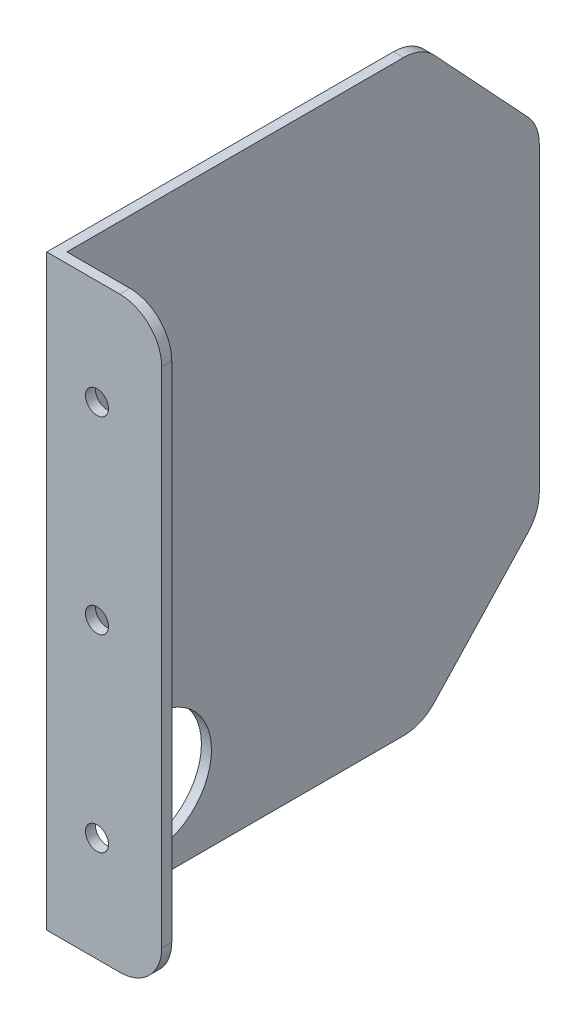
ISO-10303-21;
HEADER;
FILE_DESCRIPTION(('STEP AP214'),'2;1');
FILE_NAME('part.step','',(''),(''),'','','');
FILE_SCHEMA(('AUTOMOTIVE_DESIGN { 1 0 10303 214 1 1 1 1 }'));
ENDSEC;
DATA;
#1=APPLICATION_CONTEXT('core data for automotive mechanical design processes');
#2=APPLICATION_PROTOCOL_DEFINITION('international standard','automotive_design',2000,#1);
#3=PRODUCT_CONTEXT('',#1,'mechanical');
#4=PRODUCT('Part','Part','',(#3));
#5=PRODUCT_RELATED_PRODUCT_CATEGORY('part','',(#4));
#6=PRODUCT_DEFINITION_FORMATION('','',#4);
#7=PRODUCT_DEFINITION_CONTEXT('part definition',#1,'design');
#8=PRODUCT_DEFINITION('design','',#6,#7);
#9=PRODUCT_DEFINITION_SHAPE('','',#8);
#10=(LENGTH_UNIT() NAMED_UNIT(*) SI_UNIT(.MILLI.,.METRE.));
#11=(NAMED_UNIT(*) PLANE_ANGLE_UNIT() SI_UNIT($,.RADIAN.));
#12=(NAMED_UNIT(*) SI_UNIT($,.STERADIAN.) SOLID_ANGLE_UNIT());
#13=UNCERTAINTY_MEASURE_WITH_UNIT(LENGTH_MEASURE(1.E-05),#10,'distance_accuracy_value','');
#14=(GEOMETRIC_REPRESENTATION_CONTEXT(3) GLOBAL_UNCERTAINTY_ASSIGNED_CONTEXT((#13)) GLOBAL_UNIT_ASSIGNED_CONTEXT((#10,
#11,#12)) REPRESENTATION_CONTEXT('',''));
#15=CARTESIAN_POINT('',(0.,0.,0.));
#16=DIRECTION('',(0.,0.,1.));
#17=DIRECTION('',(1.,0.,0.));
#18=AXIS2_PLACEMENT_3D('',#15,#16,#17);
#19=CARTESIAN_POINT('',(2.4,0.,0.));
#20=DIRECTION('',(0.,0.,-1.));
#21=DIRECTION('',(0.,1.,0.));
#22=AXIS2_PLACEMENT_3D('',#19,#20,#21);
#23=PLANE('',#22);
#24=CARTESIAN_POINT('',(11.9749835807568,-115.,0.));
#25=DIRECTION('',(0.,0.,1.));
#26=DIRECTION('',(1.,0.,0.));
#27=AXIS2_PLACEMENT_3D('',#24,#25,#26);
#28=CIRCLE('',#27,2.75);
#29=CARTESIAN_POINT('',(14.7249835807568,-115.,0.));
#30=VERTEX_POINT('',#29);
#31=EDGE_CURVE('E492',#30,#30,#28,.T.);
#32=ORIENTED_EDGE('',*,*,#31,.F.);
#33=EDGE_LOOP('',(#32));
#34=FACE_BOUND('',#33,.T.);
#35=CARTESIAN_POINT('',(11.9749835807568,-25.,0.));
#36=DIRECTION('',(0.,0.,1.));
#37=DIRECTION('',(1.,0.,0.));
#38=AXIS2_PLACEMENT_3D('',#35,#36,#37);
#39=CIRCLE('',#38,2.75);
#40=CARTESIAN_POINT('',(14.7249835807568,-25.,0.));
#41=VERTEX_POINT('',#40);
#42=EDGE_CURVE('E497',#41,#41,#39,.T.);
#43=ORIENTED_EDGE('',*,*,#42,.F.);
#44=EDGE_LOOP('',(#43));
#45=FACE_BOUND('',#44,.T.);
#46=CARTESIAN_POINT('',(11.9749835807568,-70.,0.));
#47=DIRECTION('',(0.,0.,1.));
#48=DIRECTION('',(1.,0.,0.));
#49=AXIS2_PLACEMENT_3D('',#46,#47,#48);
#50=CIRCLE('',#49,2.75);
#51=CARTESIAN_POINT('',(14.7249835807568,-70.,0.));
#52=VERTEX_POINT('',#51);
#53=EDGE_CURVE('E258',#52,#52,#50,.T.);
#54=ORIENTED_EDGE('',*,*,#53,.F.);
#55=EDGE_LOOP('',(#54));
#56=FACE_BOUND('',#55,.T.);
#57=DIRECTION('',(-1.,0.,0.));
#58=VECTOR('',#57,1.);
#59=CARTESIAN_POINT('',(2.4,-140.,0.));
#60=LINE('',#59,#58);
#61=CARTESIAN_POINT('',(17.4,-140.,0.));
#62=VERTEX_POINT('',#61);
#63=CARTESIAN_POINT('',(0.,-140.,0.));
#64=VERTEX_POINT('',#63);
#65=EDGE_CURVE('E204',#62,#64,#60,.T.);
#66=ORIENTED_EDGE('',*,*,#65,.F.);
#67=CARTESIAN_POINT('',(17.4,-130.,0.));
#68=DIRECTION('',(0.,0.,-1.));
#69=DIRECTION('',(0.,1.,0.));
#70=AXIS2_PLACEMENT_3D('',#67,#68,#69);
#71=CIRCLE('',#70,10.);
#72=CARTESIAN_POINT('',(27.4,-130.,0.));
#73=VERTEX_POINT('',#72);
#74=EDGE_CURVE('E48',#62,#73,#71,.F.);
#75=ORIENTED_EDGE('',*,*,#74,.T.);
#76=DIRECTION('',(0.,-1.,0.));
#77=VECTOR('',#76,1.);
#78=CARTESIAN_POINT('',(27.4,-140.,0.));
#79=LINE('',#78,#77);
#80=CARTESIAN_POINT('',(27.4,-10.,0.));
#81=VERTEX_POINT('',#80);
#82=EDGE_CURVE('E167',#81,#73,#79,.T.);
#83=ORIENTED_EDGE('',*,*,#82,.F.);
#84=CARTESIAN_POINT('',(17.4,-10.,0.));
#85=DIRECTION('',(0.,0.,-1.));
#86=DIRECTION('',(0.,1.,0.));
#87=AXIS2_PLACEMENT_3D('',#84,#85,#86);
#88=CIRCLE('',#87,10.);
#89=CARTESIAN_POINT('',(17.4,0.,0.));
#90=VERTEX_POINT('',#89);
#91=EDGE_CURVE('E57',#81,#90,#88,.F.);
#92=ORIENTED_EDGE('',*,*,#91,.T.);
#93=DIRECTION('',(-1.,0.,0.));
#94=VECTOR('',#93,1.);
#95=CARTESIAN_POINT('',(2.4,0.,0.));
#96=LINE('',#95,#94);
#97=CARTESIAN_POINT('',(0.,0.,0.));
#98=VERTEX_POINT('',#97);
#99=EDGE_CURVE('E161',#90,#98,#96,.T.);
#100=ORIENTED_EDGE('',*,*,#99,.T.);
#101=DIRECTION('',(0.,-1.,0.));
#102=VECTOR('',#101,1.);
#103=CARTESIAN_POINT('',(0.,0.,0.));
#104=LINE('',#103,#102);
#105=EDGE_CURVE('E176',#98,#64,#104,.T.);
#106=ORIENTED_EDGE('',*,*,#105,.T.);
#107=EDGE_LOOP('',(#66,#75,#83,#92,#100,#106));
#108=FACE_BOUND('',#107,.T.);
#109=ADVANCED_FACE('F39',(#34,#45,#56,#108),#23,.F.);
#110=CARTESIAN_POINT('',(2.4,-140.,0.));
#111=DIRECTION('',(0.,1.,0.));
#112=DIRECTION('',(0.,0.,1.));
#113=AXIS2_PLACEMENT_3D('',#110,#111,#112);
#114=PLANE('',#113);
#115=DIRECTION('',(-1.,0.,0.));
#116=VECTOR('',#115,1.);
#117=CARTESIAN_POINT('',(27.4,-140.,-2.4));
#118=LINE('',#117,#116);
#119=CARTESIAN_POINT('',(17.4,-140.,-2.4));
#120=VERTEX_POINT('',#119);
#121=CARTESIAN_POINT('',(2.4,-140.,-2.4));
#122=VERTEX_POINT('',#121);
#123=EDGE_CURVE('E151',#120,#122,#118,.T.);
#124=ORIENTED_EDGE('',*,*,#123,.F.);
#125=DIRECTION('',(0.,0.,-1.));
#126=VECTOR('',#125,1.);
#127=CARTESIAN_POINT('',(17.4,-140.,0.));
#128=LINE('',#127,#126);
#129=EDGE_CURVE('E62',#120,#62,#128,.F.);
#130=ORIENTED_EDGE('',*,*,#129,.T.);
#131=ORIENTED_EDGE('',*,*,#65,.T.);
#132=DIRECTION('',(0.,0.,-1.));
#133=VECTOR('',#132,1.);
#134=CARTESIAN_POINT('',(0.,-140.,0.));
#135=LINE('',#134,#133);
#136=CARTESIAN_POINT('',(0.,-140.,-82.6544769808779));
#137=VERTEX_POINT('',#136);
#138=EDGE_CURVE('E193',#64,#137,#135,.T.);
#139=ORIENTED_EDGE('',*,*,#138,.T.);
#140=DIRECTION('',(1.,0.,0.));
#141=VECTOR('',#140,1.);
#142=CARTESIAN_POINT('',(2.4,-140.,-82.6544769808779));
#143=LINE('',#142,#141);
#144=CARTESIAN_POINT('',(2.4,-140.,-82.6544769808779));
#145=VERTEX_POINT('',#144);
#146=EDGE_CURVE('E206',#137,#145,#143,.T.);
#147=ORIENTED_EDGE('',*,*,#146,.T.);
#148=DIRECTION('',(0.,0.,-1.));
#149=VECTOR('',#148,1.);
#150=CARTESIAN_POINT('',(2.4,-140.,0.));
#151=LINE('',#150,#149);
#152=EDGE_CURVE('E186',#122,#145,#151,.T.);
#153=ORIENTED_EDGE('',*,*,#152,.F.);
#154=EDGE_LOOP('',(#124,#130,#131,#139,#147,#153));
#155=FACE_BOUND('',#154,.T.);
#156=ADVANCED_FACE('F278',(#155),#114,.F.);
#157=CARTESIAN_POINT('',(2.4,0.,-115.));
#158=DIRECTION('',(0.,0.,1.));
#159=DIRECTION('',(0.,-1.,0.));
#160=AXIS2_PLACEMENT_3D('',#157,#158,#159);
#161=PLANE('',#160);
#162=DIRECTION('',(0.,1.,0.));
#163=VECTOR('',#162,1.);
#164=CARTESIAN_POINT('',(2.4,0.,-115.));
#165=LINE('',#164,#163);
#166=CARTESIAN_POINT('',(2.4,-106.058368193798,-115.));
#167=VERTEX_POINT('',#166);
#168=CARTESIAN_POINT('',(2.4,-33.9416318062023,-115.));
#169=VERTEX_POINT('',#168);
#170=EDGE_CURVE('E165',#167,#169,#165,.T.);
#171=ORIENTED_EDGE('',*,*,#170,.F.);
#172=DIRECTION('',(1.,0.,0.));
#173=VECTOR('',#172,1.);
#174=CARTESIAN_POINT('',(2.4,-106.058368193798,-115.));
#175=LINE('',#174,#173);
#176=CARTESIAN_POINT('',(0.,-106.058368193798,-115.));
#177=VERTEX_POINT('',#176);
#178=EDGE_CURVE('E235',#167,#177,#175,.F.);
#179=ORIENTED_EDGE('',*,*,#178,.T.);
#180=DIRECTION('',(0.,1.,0.));
#181=VECTOR('',#180,1.);
#182=CARTESIAN_POINT('',(0.,0.,-115.));
#183=LINE('',#182,#181);
#184=CARTESIAN_POINT('',(0.,-33.9416318062023,-115.));
#185=VERTEX_POINT('',#184);
#186=EDGE_CURVE('E196',#177,#185,#183,.T.);
#187=ORIENTED_EDGE('',*,*,#186,.T.);
#188=DIRECTION('',(1.,0.,0.));
#189=VECTOR('',#188,1.);
#190=CARTESIAN_POINT('',(2.4,-33.9416318062023,-115.));
#191=LINE('',#190,#189);
#192=EDGE_CURVE('E227',#185,#169,#191,.T.);
#193=ORIENTED_EDGE('',*,*,#192,.T.);
#194=EDGE_LOOP('',(#171,#179,#187,#193));
#195=FACE_BOUND('',#194,.T.);
#196=ADVANCED_FACE('F289',(#195),#161,.F.);
#197=CARTESIAN_POINT('',(2.4,0.,0.));
#198=DIRECTION('',(0.,-1.,0.));
#199=DIRECTION('',(0.,0.,-1.));
#200=AXIS2_PLACEMENT_3D('',#197,#198,#199);
#201=PLANE('',#200);
#202=ORIENTED_EDGE('',*,*,#99,.F.);
#203=DIRECTION('',(0.,0.,1.));
#204=VECTOR('',#203,1.);
#205=CARTESIAN_POINT('',(17.4,0.,0.));
#206=LINE('',#205,#204);
#207=CARTESIAN_POINT('',(17.4,0.,-2.4));
#208=VERTEX_POINT('',#207);
#209=EDGE_CURVE('E11',#90,#208,#206,.F.);
#210=ORIENTED_EDGE('',*,*,#209,.T.);
#211=DIRECTION('',(-1.,0.,0.));
#212=VECTOR('',#211,1.);
#213=CARTESIAN_POINT('',(27.4,0.,-2.4));
#214=LINE('',#213,#212);
#215=CARTESIAN_POINT('',(2.4,0.,-2.4));
#216=VERTEX_POINT('',#215);
#217=EDGE_CURVE('E142',#208,#216,#214,.T.);
#218=ORIENTED_EDGE('',*,*,#217,.T.);
#219=DIRECTION('',(0.,0.,1.));
#220=VECTOR('',#219,1.);
#221=CARTESIAN_POINT('',(2.4,0.,0.));
#222=LINE('',#221,#220);
#223=CARTESIAN_POINT('',(2.4,0.,-82.6544769808779));
#224=VERTEX_POINT('',#223);
#225=EDGE_CURVE('E144',#224,#216,#222,.T.);
#226=ORIENTED_EDGE('',*,*,#225,.F.);
#227=DIRECTION('',(1.,0.,0.));
#228=VECTOR('',#227,1.);
#229=CARTESIAN_POINT('',(2.4,0.,-82.6544769808779));
#230=LINE('',#229,#228);
#231=CARTESIAN_POINT('',(0.,0.,-82.6544769808779));
#232=VERTEX_POINT('',#231);
#233=EDGE_CURVE('E239',#224,#232,#230,.F.);
#234=ORIENTED_EDGE('',*,*,#233,.T.);
#235=DIRECTION('',(0.,0.,1.));
#236=VECTOR('',#235,1.);
#237=CARTESIAN_POINT('',(0.,0.,0.));
#238=LINE('',#237,#236);
#239=EDGE_CURVE('E189',#232,#98,#238,.T.);
#240=ORIENTED_EDGE('',*,*,#239,.T.);
#241=EDGE_LOOP('',(#202,#210,#218,#226,#234,#240));
#242=FACE_BOUND('',#241,.T.);
#243=ADVANCED_FACE('F145',(#242),#201,.F.);
#244=CARTESIAN_POINT('',(2.4,0.,0.));
#245=DIRECTION('',(1.,0.,0.));
#246=DIRECTION('',(0.,0.,-1.));
#247=AXIS2_PLACEMENT_3D('',#244,#245,#246);
#248=PLANE('',#247);
#249=CARTESIAN_POINT('',(2.4,-120.,-22.5916993338302));
#250=DIRECTION('',(1.,0.,0.));
#251=DIRECTION('',(0.,0.,-1.));
#252=AXIS2_PLACEMENT_3D('',#249,#250,#251);
#253=CIRCLE('',#252,14.275);
#254=CARTESIAN_POINT('',(2.4,-120.,-36.8666993338302));
#255=VERTEX_POINT('',#254);
#256=EDGE_CURVE('E491',#255,#255,#253,.T.);
#257=ORIENTED_EDGE('',*,*,#256,.F.);
#258=EDGE_LOOP('',(#257));
#259=FACE_BOUND('',#258,.T.);
#260=DIRECTION('',(0.,1.,0.));
#261=VECTOR('',#260,1.);
#262=CARTESIAN_POINT('',(2.4,-140.,-2.4));
#263=LINE('',#262,#261);
#264=EDGE_CURVE('E160',#122,#216,#263,.T.);
#265=ORIENTED_EDGE('',*,*,#264,.F.);
#266=ORIENTED_EDGE('',*,*,#152,.T.);
#267=CARTESIAN_POINT('',(2.4,-130.,-82.6544769808779));
#268=DIRECTION('',(1.,0.,0.));
#269=DIRECTION('',(0.,0.,-1.));
#270=AXIS2_PLACEMENT_3D('',#267,#268,#269);
#271=CIRCLE('',#270,10.);
#272=CARTESIAN_POINT('',(2.4,-136.8231825036,-89.9650296633066));
#273=VERTEX_POINT('',#272);
#274=EDGE_CURVE('E212',#145,#273,#271,.T.);
#275=ORIENTED_EDGE('',*,*,#274,.T.);
#276=DIRECTION('',(0.,-0.731055268242869,0.682318250360011));
#277=VECTOR('',#276,1.);
#278=CARTESIAN_POINT('',(2.4,-110.,-115.));
#279=LINE('',#278,#277);
#280=CARTESIAN_POINT('',(2.4,-112.881550697398,-112.310552682429));
#281=VERTEX_POINT('',#280);
#282=EDGE_CURVE('E181',#281,#273,#279,.T.);
#283=ORIENTED_EDGE('',*,*,#282,.F.);
#284=CARTESIAN_POINT('',(2.4,-106.058368193798,-105.));
#285=DIRECTION('',(1.,0.,0.));
#286=DIRECTION('',(0.,0.,-1.));
#287=AXIS2_PLACEMENT_3D('',#284,#285,#286);
#288=CIRCLE('',#287,10.);
#289=EDGE_CURVE('E215',#281,#167,#288,.T.);
#290=ORIENTED_EDGE('',*,*,#289,.T.);
#291=ORIENTED_EDGE('',*,*,#170,.T.);
#292=CARTESIAN_POINT('',(2.4,-33.9416318062023,-105.));
#293=DIRECTION('',(1.,0.,0.));
#294=DIRECTION('',(0.,0.,-1.));
#295=AXIS2_PLACEMENT_3D('',#292,#293,#294);
#296=CIRCLE('',#295,10.);
#297=CARTESIAN_POINT('',(2.4,-27.1184493026022,-112.310552682429));
#298=VERTEX_POINT('',#297);
#299=EDGE_CURVE('E209',#169,#298,#296,.T.);
#300=ORIENTED_EDGE('',*,*,#299,.T.);
#301=DIRECTION('',(0.,-0.731055268242869,-0.682318250360012));
#302=VECTOR('',#301,1.);
#303=CARTESIAN_POINT('',(2.4,0.,-87.));
#304=LINE('',#303,#302);
#305=CARTESIAN_POINT('',(2.4,-3.17681749639988,-89.9650296633066));
#306=VERTEX_POINT('',#305);
#307=EDGE_CURVE('E178',#306,#298,#304,.T.);
#308=ORIENTED_EDGE('',*,*,#307,.F.);
#309=CARTESIAN_POINT('',(2.4,-10.,-82.6544769808779));
#310=DIRECTION('',(1.,0.,0.));
#311=DIRECTION('',(0.,0.,-1.));
#312=AXIS2_PLACEMENT_3D('',#309,#310,#311);
#313=CIRCLE('',#312,10.);
#314=EDGE_CURVE('E159',#306,#224,#313,.T.);
#315=ORIENTED_EDGE('',*,*,#314,.T.);
#316=ORIENTED_EDGE('',*,*,#225,.T.);
#317=EDGE_LOOP('',(#265,#266,#275,#283,#290,#291,#300,#308,#315,#316));
#318=FACE_BOUND('',#317,.T.);
#319=ADVANCED_FACE('F156',(#259,#318),#248,.T.);
#320=CARTESIAN_POINT('',(0.,0.,0.));
#321=DIRECTION('',(1.,0.,0.));
#322=DIRECTION('',(0.,0.,-1.));
#323=AXIS2_PLACEMENT_3D('',#320,#321,#322);
#324=PLANE('',#323);
#325=CARTESIAN_POINT('',(0.,-120.,-22.5916993338302));
#326=DIRECTION('',(1.,0.,0.));
#327=DIRECTION('',(0.,0.,-1.));
#328=AXIS2_PLACEMENT_3D('',#325,#326,#327);
#329=CIRCLE('',#328,14.275);
#330=CARTESIAN_POINT('',(0.,-120.,-36.8666993338302));
#331=VERTEX_POINT('',#330);
#332=EDGE_CURVE('E488',#331,#331,#329,.T.);
#333=ORIENTED_EDGE('',*,*,#332,.T.);
#334=EDGE_LOOP('',(#333));
#335=FACE_BOUND('',#334,.T.);
#336=DIRECTION('',(0.,-0.731055268242869,0.682318250360011));
#337=VECTOR('',#336,1.);
#338=CARTESIAN_POINT('',(0.,-110.,-115.));
#339=LINE('',#338,#337);
#340=CARTESIAN_POINT('',(0.,-112.881550697398,-112.310552682429));
#341=VERTEX_POINT('',#340);
#342=CARTESIAN_POINT('',(0.,-136.8231825036,-89.9650296633066));
#343=VERTEX_POINT('',#342);
#344=EDGE_CURVE('E174',#341,#343,#339,.T.);
#345=ORIENTED_EDGE('',*,*,#344,.T.);
#346=CARTESIAN_POINT('',(0.,-130.,-82.6544769808779));
#347=DIRECTION('',(1.,0.,0.));
#348=DIRECTION('',(0.,0.,-1.));
#349=AXIS2_PLACEMENT_3D('',#346,#347,#348);
#350=CIRCLE('',#349,10.);
#351=EDGE_CURVE('E230',#343,#137,#350,.F.);
#352=ORIENTED_EDGE('',*,*,#351,.T.);
#353=ORIENTED_EDGE('',*,*,#138,.F.);
#354=ORIENTED_EDGE('',*,*,#105,.F.);
#355=ORIENTED_EDGE('',*,*,#239,.F.);
#356=CARTESIAN_POINT('',(0.,-10.,-82.6544769808779));
#357=DIRECTION('',(1.,0.,0.));
#358=DIRECTION('',(0.,0.,-1.));
#359=AXIS2_PLACEMENT_3D('',#356,#357,#358);
#360=CIRCLE('',#359,10.);
#361=CARTESIAN_POINT('',(0.,-3.17681749639988,-89.9650296633066));
#362=VERTEX_POINT('',#361);
#363=EDGE_CURVE('E222',#232,#362,#360,.F.);
#364=ORIENTED_EDGE('',*,*,#363,.T.);
#365=DIRECTION('',(0.,-0.731055268242869,-0.682318250360012));
#366=VECTOR('',#365,1.);
#367=CARTESIAN_POINT('',(0.,0.,-87.));
#368=LINE('',#367,#366);
#369=CARTESIAN_POINT('',(0.,-27.1184493026022,-112.310552682429));
#370=VERTEX_POINT('',#369);
#371=EDGE_CURVE('E177',#362,#370,#368,.T.);
#372=ORIENTED_EDGE('',*,*,#371,.T.);
#373=CARTESIAN_POINT('',(0.,-33.9416318062023,-105.));
#374=DIRECTION('',(1.,0.,0.));
#375=DIRECTION('',(0.,0.,-1.));
#376=AXIS2_PLACEMENT_3D('',#373,#374,#375);
#377=CIRCLE('',#376,10.);
#378=EDGE_CURVE('E224',#370,#185,#377,.F.);
#379=ORIENTED_EDGE('',*,*,#378,.T.);
#380=ORIENTED_EDGE('',*,*,#186,.F.);
#381=CARTESIAN_POINT('',(0.,-106.058368193798,-105.));
#382=DIRECTION('',(1.,0.,0.));
#383=DIRECTION('',(0.,0.,-1.));
#384=AXIS2_PLACEMENT_3D('',#381,#382,#383);
#385=CIRCLE('',#384,10.);
#386=EDGE_CURVE('E223',#177,#341,#385,.F.);
#387=ORIENTED_EDGE('',*,*,#386,.T.);
#388=EDGE_LOOP('',(#345,#352,#353,#354,#355,#364,#372,#379,#380,#387));
#389=FACE_BOUND('',#388,.T.);
#390=ADVANCED_FACE('F334',(#335,#389),#324,.F.);
#391=CARTESIAN_POINT('',(0.,0.,-87.));
#392=DIRECTION('',(0.,-0.682318250360011,0.731055268242869));
#393=DIRECTION('',(0.,-0.731055268242869,-0.682318250360012));
#394=AXIS2_PLACEMENT_3D('',#391,#392,#393);
#395=PLANE('',#394);
#396=ORIENTED_EDGE('',*,*,#307,.T.);
#397=DIRECTION('',(1.,0.,0.));
#398=VECTOR('',#397,1.);
#399=CARTESIAN_POINT('',(0.,-27.1184493026021,-112.310552682429));
#400=LINE('',#399,#398);
#401=EDGE_CURVE('E240',#298,#370,#400,.F.);
#402=ORIENTED_EDGE('',*,*,#401,.T.);
#403=ORIENTED_EDGE('',*,*,#371,.F.);
#404=DIRECTION('',(1.,0.,0.));
#405=VECTOR('',#404,1.);
#406=CARTESIAN_POINT('',(0.,-3.17681749639988,-89.9650296633066));
#407=LINE('',#406,#405);
#408=EDGE_CURVE('E231',#362,#306,#407,.T.);
#409=ORIENTED_EDGE('',*,*,#408,.T.);
#410=EDGE_LOOP('',(#396,#402,#403,#409));
#411=FACE_BOUND('',#410,.T.);
#412=ADVANCED_FACE('F341',(#411),#395,.F.);
#413=CARTESIAN_POINT('',(0.,-110.,-115.));
#414=DIRECTION('',(0.,0.682318250360011,0.731055268242869));
#415=DIRECTION('',(0.,-0.731055268242869,0.682318250360011));
#416=AXIS2_PLACEMENT_3D('',#413,#414,#415);
#417=PLANE('',#416);
#418=ORIENTED_EDGE('',*,*,#282,.T.);
#419=DIRECTION('',(1.,0.,0.));
#420=VECTOR('',#419,1.);
#421=CARTESIAN_POINT('',(0.,-136.8231825036,-89.9650296633066));
#422=LINE('',#421,#420);
#423=EDGE_CURVE('E218',#273,#343,#422,.F.);
#424=ORIENTED_EDGE('',*,*,#423,.T.);
#425=ORIENTED_EDGE('',*,*,#344,.F.);
#426=DIRECTION('',(1.,0.,0.));
#427=VECTOR('',#426,1.);
#428=CARTESIAN_POINT('',(0.,-112.881550697398,-112.310552682429));
#429=LINE('',#428,#427);
#430=EDGE_CURVE('E216',#341,#281,#429,.T.);
#431=ORIENTED_EDGE('',*,*,#430,.T.);
#432=EDGE_LOOP('',(#418,#424,#425,#431));
#433=FACE_BOUND('',#432,.T.);
#434=ADVANCED_FACE('F296',(#433),#417,.F.);
#435=CARTESIAN_POINT('',(2.4,-130.,-82.6544769808779));
#436=DIRECTION('',(1.,0.,0.));
#437=DIRECTION('',(0.,0.,-1.));
#438=AXIS2_PLACEMENT_3D('',#435,#436,#437);
#439=CYLINDRICAL_SURFACE('',#438,10.);
#440=ORIENTED_EDGE('',*,*,#351,.F.);
#441=ORIENTED_EDGE('',*,*,#423,.F.);
#442=ORIENTED_EDGE('',*,*,#274,.F.);
#443=ORIENTED_EDGE('',*,*,#146,.F.);
#444=EDGE_LOOP('',(#440,#441,#442,#443));
#445=FACE_BOUND('',#444,.T.);
#446=ADVANCED_FACE('F294',(#445),#439,.T.);
#447=CARTESIAN_POINT('',(0.,-106.058368193798,-105.));
#448=DIRECTION('',(1.,0.,0.));
#449=DIRECTION('',(0.,0.,-1.));
#450=AXIS2_PLACEMENT_3D('',#447,#448,#449);
#451=CYLINDRICAL_SURFACE('',#450,10.);
#452=ORIENTED_EDGE('',*,*,#386,.F.);
#453=ORIENTED_EDGE('',*,*,#178,.F.);
#454=ORIENTED_EDGE('',*,*,#289,.F.);
#455=ORIENTED_EDGE('',*,*,#430,.F.);
#456=EDGE_LOOP('',(#452,#453,#454,#455));
#457=FACE_BOUND('',#456,.T.);
#458=ADVANCED_FACE('F300',(#457),#451,.T.);
#459=CARTESIAN_POINT('',(2.4,-33.9416318062023,-105.));
#460=DIRECTION('',(1.,0.,0.));
#461=DIRECTION('',(0.,0.,-1.));
#462=AXIS2_PLACEMENT_3D('',#459,#460,#461);
#463=CYLINDRICAL_SURFACE('',#462,10.);
#464=ORIENTED_EDGE('',*,*,#378,.F.);
#465=ORIENTED_EDGE('',*,*,#401,.F.);
#466=ORIENTED_EDGE('',*,*,#299,.F.);
#467=ORIENTED_EDGE('',*,*,#192,.F.);
#468=EDGE_LOOP('',(#464,#465,#466,#467));
#469=FACE_BOUND('',#468,.T.);
#470=ADVANCED_FACE('F305',(#469),#463,.T.);
#471=CARTESIAN_POINT('',(0.,-10.,-82.6544769808779));
#472=DIRECTION('',(1.,0.,0.));
#473=DIRECTION('',(0.,0.,-1.));
#474=AXIS2_PLACEMENT_3D('',#471,#472,#473);
#475=CYLINDRICAL_SURFACE('',#474,10.);
#476=ORIENTED_EDGE('',*,*,#363,.F.);
#477=ORIENTED_EDGE('',*,*,#233,.F.);
#478=ORIENTED_EDGE('',*,*,#314,.F.);
#479=ORIENTED_EDGE('',*,*,#408,.F.);
#480=EDGE_LOOP('',(#476,#477,#478,#479));
#481=FACE_BOUND('',#480,.T.);
#482=ADVANCED_FACE('F308',(#481),#475,.T.);
#483=CARTESIAN_POINT('',(27.4,-140.,-2.4));
#484=DIRECTION('',(0.,0.,1.));
#485=DIRECTION('',(1.,0.,0.));
#486=AXIS2_PLACEMENT_3D('',#483,#484,#485);
#487=PLANE('',#486);
#488=CARTESIAN_POINT('',(11.9749835807568,-115.,-2.4));
#489=DIRECTION('',(0.,0.,1.));
#490=DIRECTION('',(1.,0.,0.));
#491=AXIS2_PLACEMENT_3D('',#488,#489,#490);
#492=CIRCLE('',#491,2.75);
#493=CARTESIAN_POINT('',(14.7249835807568,-115.,-2.4));
#494=VERTEX_POINT('',#493);
#495=EDGE_CURVE('E43',#494,#494,#492,.T.);
#496=ORIENTED_EDGE('',*,*,#495,.T.);
#497=EDGE_LOOP('',(#496));
#498=FACE_BOUND('',#497,.T.);
#499=CARTESIAN_POINT('',(11.9749835807568,-25.,-2.4));
#500=DIRECTION('',(0.,0.,1.));
#501=DIRECTION('',(1.,0.,0.));
#502=AXIS2_PLACEMENT_3D('',#499,#500,#501);
#503=CIRCLE('',#502,2.75);
#504=CARTESIAN_POINT('',(14.7249835807568,-25.,-2.4));
#505=VERTEX_POINT('',#504);
#506=EDGE_CURVE('E173',#505,#505,#503,.T.);
#507=ORIENTED_EDGE('',*,*,#506,.T.);
#508=EDGE_LOOP('',(#507));
#509=FACE_BOUND('',#508,.T.);
#510=CARTESIAN_POINT('',(11.9749835807568,-70.,-2.4));
#511=DIRECTION('',(0.,0.,1.));
#512=DIRECTION('',(1.,0.,0.));
#513=AXIS2_PLACEMENT_3D('',#510,#511,#512);
#514=CIRCLE('',#513,2.75);
#515=CARTESIAN_POINT('',(14.7249835807568,-70.,-2.4));
#516=VERTEX_POINT('',#515);
#517=EDGE_CURVE('E255',#516,#516,#514,.T.);
#518=ORIENTED_EDGE('',*,*,#517,.T.);
#519=EDGE_LOOP('',(#518));
#520=FACE_BOUND('',#519,.T.);
#521=DIRECTION('',(0.,1.,0.));
#522=VECTOR('',#521,1.);
#523=CARTESIAN_POINT('',(27.4,-140.,-2.4));
#524=LINE('',#523,#522);
#525=CARTESIAN_POINT('',(27.4,-130.,-2.4));
#526=VERTEX_POINT('',#525);
#527=CARTESIAN_POINT('',(27.4,-10.,-2.4));
#528=VERTEX_POINT('',#527);
#529=EDGE_CURVE('E155',#526,#528,#524,.T.);
#530=ORIENTED_EDGE('',*,*,#529,.F.);
#531=CARTESIAN_POINT('',(17.4,-130.,-2.4));
#532=DIRECTION('',(0.,0.,1.));
#533=DIRECTION('',(1.,0.,0.));
#534=AXIS2_PLACEMENT_3D('',#531,#532,#533);
#535=CIRCLE('',#534,10.);
#536=EDGE_CURVE('E246',#526,#120,#535,.F.);
#537=ORIENTED_EDGE('',*,*,#536,.T.);
#538=ORIENTED_EDGE('',*,*,#123,.T.);
#539=ORIENTED_EDGE('',*,*,#264,.T.);
#540=ORIENTED_EDGE('',*,*,#217,.F.);
#541=CARTESIAN_POINT('',(17.4,-10.,-2.4));
#542=DIRECTION('',(0.,0.,1.));
#543=DIRECTION('',(1.,0.,0.));
#544=AXIS2_PLACEMENT_3D('',#541,#542,#543);
#545=CIRCLE('',#544,10.);
#546=EDGE_CURVE('E250',#208,#528,#545,.F.);
#547=ORIENTED_EDGE('',*,*,#546,.T.);
#548=EDGE_LOOP('',(#530,#537,#538,#539,#540,#547));
#549=FACE_BOUND('',#548,.T.);
#550=ADVANCED_FACE('F164',(#498,#509,#520,#549),#487,.F.);
#551=CARTESIAN_POINT('',(27.4,0.,0.));
#552=DIRECTION('',(-1.,0.,0.));
#553=DIRECTION('',(0.,0.,1.));
#554=AXIS2_PLACEMENT_3D('',#551,#552,#553);
#555=PLANE('',#554);
#556=ORIENTED_EDGE('',*,*,#82,.T.);
#557=DIRECTION('',(0.,0.,-1.));
#558=VECTOR('',#557,1.);
#559=CARTESIAN_POINT('',(27.4,-130.,0.));
#560=LINE('',#559,#558);
#561=EDGE_CURVE('E242',#73,#526,#560,.T.);
#562=ORIENTED_EDGE('',*,*,#561,.T.);
#563=ORIENTED_EDGE('',*,*,#529,.T.);
#564=DIRECTION('',(0.,0.,1.));
#565=VECTOR('',#564,1.);
#566=CARTESIAN_POINT('',(27.4,-10.,0.));
#567=LINE('',#566,#565);
#568=EDGE_CURVE('E243',#528,#81,#567,.T.);
#569=ORIENTED_EDGE('',*,*,#568,.T.);
#570=EDGE_LOOP('',(#556,#562,#563,#569));
#571=FACE_BOUND('',#570,.T.);
#572=ADVANCED_FACE('F315',(#571),#555,.F.);
#573=CARTESIAN_POINT('',(17.4,-130.,0.));
#574=DIRECTION('',(0.,0.,-1.));
#575=DIRECTION('',(-1.,0.,0.));
#576=AXIS2_PLACEMENT_3D('',#573,#574,#575);
#577=CYLINDRICAL_SURFACE('',#576,10.);
#578=ORIENTED_EDGE('',*,*,#74,.F.);
#579=ORIENTED_EDGE('',*,*,#129,.F.);
#580=ORIENTED_EDGE('',*,*,#536,.F.);
#581=ORIENTED_EDGE('',*,*,#561,.F.);
#582=EDGE_LOOP('',(#578,#579,#580,#581));
#583=FACE_BOUND('',#582,.T.);
#584=ADVANCED_FACE('F309',(#583),#577,.T.);
#585=CARTESIAN_POINT('',(17.4,-10.,0.));
#586=DIRECTION('',(0.,0.,1.));
#587=DIRECTION('',(1.,0.,0.));
#588=AXIS2_PLACEMENT_3D('',#585,#586,#587);
#589=CYLINDRICAL_SURFACE('',#588,10.);
#590=ORIENTED_EDGE('',*,*,#546,.F.);
#591=ORIENTED_EDGE('',*,*,#209,.F.);
#592=ORIENTED_EDGE('',*,*,#91,.F.);
#593=ORIENTED_EDGE('',*,*,#568,.F.);
#594=EDGE_LOOP('',(#590,#591,#592,#593));
#595=FACE_BOUND('',#594,.T.);
#596=ADVANCED_FACE('F41',(#595),#589,.T.);
#597=CARTESIAN_POINT('',(11.9749835807568,-70.,-115.));
#598=DIRECTION('',(0.,0.,1.));
#599=DIRECTION('',(1.,0.,0.));
#600=AXIS2_PLACEMENT_3D('',#597,#598,#599);
#601=CYLINDRICAL_SURFACE('',#600,2.75);
#602=ORIENTED_EDGE('',*,*,#53,.T.);
#603=EDGE_LOOP('',(#602));
#604=FACE_BOUND('',#603,.T.);
#605=ORIENTED_EDGE('',*,*,#517,.F.);
#606=EDGE_LOOP('',(#605));
#607=FACE_BOUND('',#606,.T.);
#608=ADVANCED_FACE('F264',(#604,#607),#601,.F.);
#609=CARTESIAN_POINT('',(11.9749835807568,-25.,-115.));
#610=DIRECTION('',(0.,0.,1.));
#611=DIRECTION('',(1.,0.,0.));
#612=AXIS2_PLACEMENT_3D('',#609,#610,#611);
#613=CYLINDRICAL_SURFACE('',#612,2.75);
#614=ORIENTED_EDGE('',*,*,#42,.T.);
#615=EDGE_LOOP('',(#614));
#616=FACE_BOUND('',#615,.T.);
#617=ORIENTED_EDGE('',*,*,#506,.F.);
#618=EDGE_LOOP('',(#617));
#619=FACE_BOUND('',#618,.T.);
#620=ADVANCED_FACE('F265',(#616,#619),#613,.F.);
#621=CARTESIAN_POINT('',(11.9749835807568,-115.,-115.));
#622=DIRECTION('',(0.,0.,1.));
#623=DIRECTION('',(1.,0.,0.));
#624=AXIS2_PLACEMENT_3D('',#621,#622,#623);
#625=CYLINDRICAL_SURFACE('',#624,2.75);
#626=ORIENTED_EDGE('',*,*,#31,.T.);
#627=EDGE_LOOP('',(#626));
#628=FACE_BOUND('',#627,.T.);
#629=ORIENTED_EDGE('',*,*,#495,.F.);
#630=EDGE_LOOP('',(#629));
#631=FACE_BOUND('',#630,.T.);
#632=ADVANCED_FACE('F262',(#628,#631),#625,.F.);
#633=CARTESIAN_POINT('',(0.,-120.,-22.5916993338302));
#634=DIRECTION('',(1.,0.,0.));
#635=DIRECTION('',(0.,0.,-1.));
#636=AXIS2_PLACEMENT_3D('',#633,#634,#635);
#637=CYLINDRICAL_SURFACE('',#636,14.275);
#638=ORIENTED_EDGE('',*,*,#332,.F.);
#639=EDGE_LOOP('',(#638));
#640=FACE_BOUND('',#639,.T.);
#641=ORIENTED_EDGE('',*,*,#256,.T.);
#642=EDGE_LOOP('',(#641));
#643=FACE_BOUND('',#642,.T.);
#644=ADVANCED_FACE('F275',(#640,#643),#637,.F.);
#645=CLOSED_SHELL('',(#109,#156,#196,#243,#319,#390,#412,#434,#446,#458,#470,#482,#550,#572,
#584,#596,#608,#620,#632,#644));
#646=MANIFOLD_SOLID_BREP('B2',#645);
#647=ADVANCED_BREP_SHAPE_REPRESENTATION('',(#18,#646),#14);
#648=SHAPE_DEFINITION_REPRESENTATION(#9,#647);
ENDSEC;
END-ISO-10303-21;
